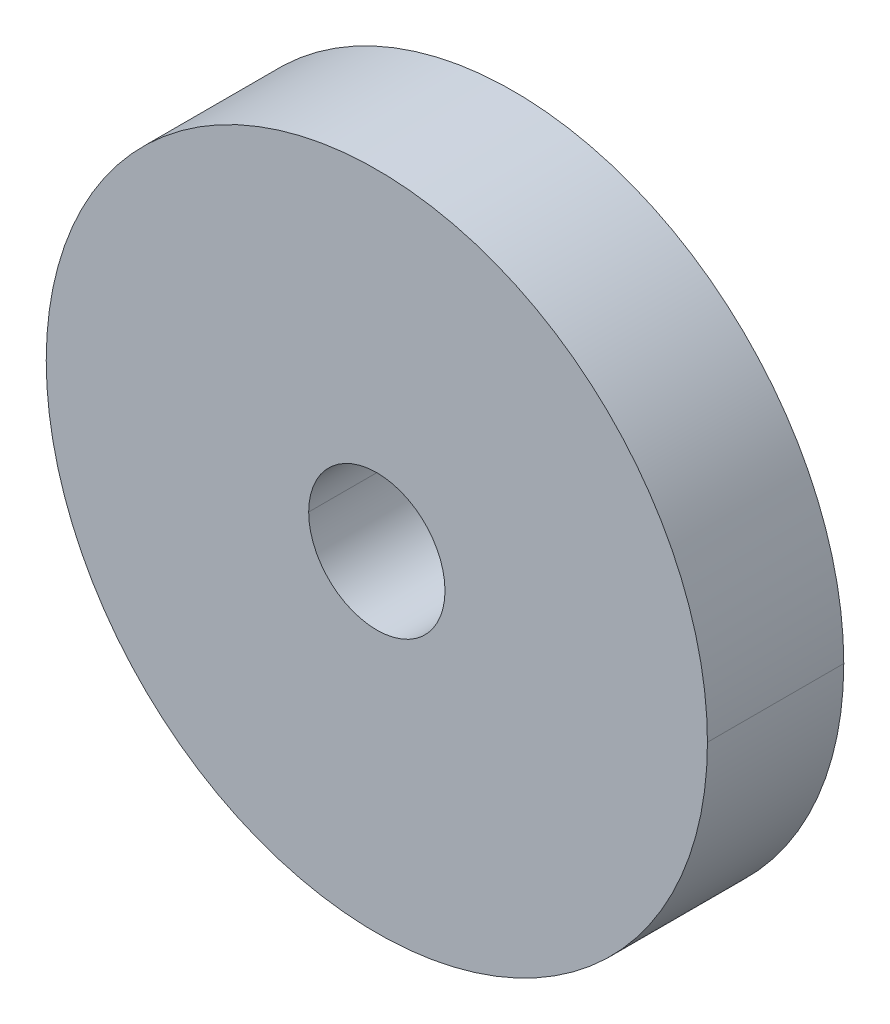
ISO-10303-21;
HEADER;
FILE_DESCRIPTION(('STEP AP214'),'2;1');
FILE_NAME('part.step','',(''),(''),'','','');
FILE_SCHEMA(('AUTOMOTIVE_DESIGN { 1 0 10303 214 1 1 1 1 }'));
ENDSEC;
DATA;
#1=APPLICATION_CONTEXT('core data for automotive mechanical design processes');
#2=APPLICATION_PROTOCOL_DEFINITION('international standard','automotive_design',2000,#1);
#3=PRODUCT_CONTEXT('',#1,'mechanical');
#4=PRODUCT('Part','Part','',(#3));
#5=PRODUCT_RELATED_PRODUCT_CATEGORY('part','',(#4));
#6=PRODUCT_DEFINITION_FORMATION('','',#4);
#7=PRODUCT_DEFINITION_CONTEXT('part definition',#1,'design');
#8=PRODUCT_DEFINITION('design','',#6,#7);
#9=PRODUCT_DEFINITION_SHAPE('','',#8);
#10=(LENGTH_UNIT() NAMED_UNIT(*) SI_UNIT(.MILLI.,.METRE.));
#11=(NAMED_UNIT(*) PLANE_ANGLE_UNIT() SI_UNIT($,.RADIAN.));
#12=(NAMED_UNIT(*) SI_UNIT($,.STERADIAN.) SOLID_ANGLE_UNIT());
#13=UNCERTAINTY_MEASURE_WITH_UNIT(LENGTH_MEASURE(1.E-05),#10,'distance_accuracy_value','');
#14=(GEOMETRIC_REPRESENTATION_CONTEXT(3) GLOBAL_UNCERTAINTY_ASSIGNED_CONTEXT((#13)) GLOBAL_UNIT_ASSIGNED_CONTEXT((#10,
#11,#12)) REPRESENTATION_CONTEXT('',''));
#15=CARTESIAN_POINT('',(0.,0.,0.));
#16=DIRECTION('',(0.,0.,1.));
#17=DIRECTION('',(1.,0.,0.));
#18=AXIS2_PLACEMENT_3D('',#15,#16,#17);
#19=CARTESIAN_POINT('',(0.,0.,2.));
#20=DIRECTION('',(0.,0.,-1.));
#21=DIRECTION('',(-1.,0.,0.));
#22=AXIS2_PLACEMENT_3D('',#19,#20,#21);
#23=CYLINDRICAL_SURFACE('',#22,1.);
#24=DIRECTION('',(0.,0.,-1.));
#25=VECTOR('',#24,1.);
#26=CARTESIAN_POINT('',(1.,0.,2.));
#27=LINE('',#26,#25);
#28=CARTESIAN_POINT('',(1.,0.,2.));
#29=VERTEX_POINT('',#28);
#30=CARTESIAN_POINT('',(1.,0.,0.));
#31=VERTEX_POINT('',#30);
#32=EDGE_CURVE('E87',#29,#31,#27,.T.);
#33=ORIENTED_EDGE('',*,*,#32,.F.);
#34=CARTESIAN_POINT('',(0.,0.,2.));
#35=DIRECTION('',(0.,0.,1.));
#36=DIRECTION('',(1.,0.,0.));
#37=AXIS2_PLACEMENT_3D('',#34,#35,#36);
#38=CIRCLE('',#37,1.);
#39=CARTESIAN_POINT('',(-1.,0.,2.));
#40=VERTEX_POINT('',#39);
#41=EDGE_CURVE('E75',#29,#40,#38,.T.);
#42=ORIENTED_EDGE('',*,*,#41,.T.);
#43=DIRECTION('',(0.,0.,-1.));
#44=VECTOR('',#43,1.);
#45=CARTESIAN_POINT('',(-1.,0.,2.));
#46=LINE('',#45,#44);
#47=CARTESIAN_POINT('',(-1.,0.,0.));
#48=VERTEX_POINT('',#47);
#49=EDGE_CURVE('E84',#40,#48,#46,.T.);
#50=ORIENTED_EDGE('',*,*,#49,.T.);
#51=CARTESIAN_POINT('',(0.,0.,0.));
#52=DIRECTION('',(0.,0.,1.));
#53=DIRECTION('',(1.,0.,0.));
#54=AXIS2_PLACEMENT_3D('',#51,#52,#53);
#55=CIRCLE('',#54,1.);
#56=EDGE_CURVE('E9',#31,#48,#55,.T.);
#57=ORIENTED_EDGE('',*,*,#56,.F.);
#58=EDGE_LOOP('',(#33,#42,#50,#57));
#59=FACE_BOUND('',#58,.T.);
#60=ADVANCED_FACE('F15',(#59),#23,.F.);
#61=CARTESIAN_POINT('',(0.,0.,2.));
#62=DIRECTION('',(0.,0.,-1.));
#63=DIRECTION('',(-1.,0.,0.));
#64=AXIS2_PLACEMENT_3D('',#61,#62,#63);
#65=CYLINDRICAL_SURFACE('',#64,4.85);
#66=DIRECTION('',(0.,0.,-1.));
#67=VECTOR('',#66,1.);
#68=CARTESIAN_POINT('',(4.85,0.,2.));
#69=LINE('',#68,#67);
#70=CARTESIAN_POINT('',(4.85,0.,2.));
#71=VERTEX_POINT('',#70);
#72=CARTESIAN_POINT('',(4.85,0.,0.));
#73=VERTEX_POINT('',#72);
#74=EDGE_CURVE('E109',#71,#73,#69,.T.);
#75=ORIENTED_EDGE('',*,*,#74,.F.);
#76=CARTESIAN_POINT('',(0.,0.,2.));
#77=DIRECTION('',(0.,0.,1.));
#78=DIRECTION('',(1.,0.,0.));
#79=AXIS2_PLACEMENT_3D('',#76,#77,#78);
#80=CIRCLE('',#79,4.85);
#81=CARTESIAN_POINT('',(-4.85,0.,2.));
#82=VERTEX_POINT('',#81);
#83=EDGE_CURVE('E57',#82,#71,#80,.T.);
#84=ORIENTED_EDGE('',*,*,#83,.F.);
#85=DIRECTION('',(0.,0.,-1.));
#86=VECTOR('',#85,1.);
#87=CARTESIAN_POINT('',(-4.85,0.,2.));
#88=LINE('',#87,#86);
#89=CARTESIAN_POINT('',(-4.85,0.,0.));
#90=VERTEX_POINT('',#89);
#91=EDGE_CURVE('E114',#82,#90,#88,.T.);
#92=ORIENTED_EDGE('',*,*,#91,.T.);
#93=CARTESIAN_POINT('',(0.,0.,0.));
#94=DIRECTION('',(0.,0.,1.));
#95=DIRECTION('',(1.,0.,0.));
#96=AXIS2_PLACEMENT_3D('',#93,#94,#95);
#97=CIRCLE('',#96,4.85);
#98=EDGE_CURVE('E26',#90,#73,#97,.T.);
#99=ORIENTED_EDGE('',*,*,#98,.T.);
#100=EDGE_LOOP('',(#75,#84,#92,#99));
#101=FACE_BOUND('',#100,.T.);
#102=ADVANCED_FACE('F131',(#101),#65,.T.);
#103=CARTESIAN_POINT('',(0.,0.,0.));
#104=DIRECTION('',(0.,0.,1.));
#105=DIRECTION('',(1.,0.,0.));
#106=AXIS2_PLACEMENT_3D('',#103,#104,#105);
#107=PLANE('',#106);
#108=CARTESIAN_POINT('',(0.,0.,0.));
#109=DIRECTION('',(0.,0.,1.));
#110=DIRECTION('',(1.,0.,0.));
#111=AXIS2_PLACEMENT_3D('',#108,#109,#110);
#112=CIRCLE('',#111,1.);
#113=EDGE_CURVE('E94',#48,#31,#112,.T.);
#114=ORIENTED_EDGE('',*,*,#113,.T.);
#115=ORIENTED_EDGE('',*,*,#56,.T.);
#116=EDGE_LOOP('',(#114,#115));
#117=FACE_BOUND('',#116,.T.);
#118=ORIENTED_EDGE('',*,*,#98,.F.);
#119=CARTESIAN_POINT('',(0.,0.,0.));
#120=DIRECTION('',(0.,0.,1.));
#121=DIRECTION('',(1.,0.,0.));
#122=AXIS2_PLACEMENT_3D('',#119,#120,#121);
#123=CIRCLE('',#122,4.85);
#124=EDGE_CURVE('E112',#73,#90,#123,.T.);
#125=ORIENTED_EDGE('',*,*,#124,.F.);
#126=EDGE_LOOP('',(#118,#125));
#127=FACE_BOUND('',#126,.T.);
#128=ADVANCED_FACE('F129',(#117,#127),#107,.F.);
#129=CARTESIAN_POINT('',(0.,0.,2.));
#130=DIRECTION('',(0.,0.,1.));
#131=DIRECTION('',(1.,0.,0.));
#132=AXIS2_PLACEMENT_3D('',#129,#130,#131);
#133=PLANE('',#132);
#134=CARTESIAN_POINT('',(0.,0.,2.));
#135=DIRECTION('',(0.,0.,1.));
#136=DIRECTION('',(1.,0.,0.));
#137=AXIS2_PLACEMENT_3D('',#134,#135,#136);
#138=CIRCLE('',#137,1.);
#139=EDGE_CURVE('E19',#40,#29,#138,.T.);
#140=ORIENTED_EDGE('',*,*,#139,.F.);
#141=ORIENTED_EDGE('',*,*,#41,.F.);
#142=EDGE_LOOP('',(#140,#141));
#143=FACE_BOUND('',#142,.T.);
#144=ORIENTED_EDGE('',*,*,#83,.T.);
#145=CARTESIAN_POINT('',(0.,0.,2.));
#146=DIRECTION('',(0.,0.,1.));
#147=DIRECTION('',(1.,0.,0.));
#148=AXIS2_PLACEMENT_3D('',#145,#146,#147);
#149=CIRCLE('',#148,4.85);
#150=EDGE_CURVE('E96',#71,#82,#149,.T.);
#151=ORIENTED_EDGE('',*,*,#150,.T.);
#152=EDGE_LOOP('',(#144,#151));
#153=FACE_BOUND('',#152,.T.);
#154=ADVANCED_FACE('F98',(#143,#153),#133,.T.);
#155=CARTESIAN_POINT('',(0.,0.,2.));
#156=DIRECTION('',(0.,0.,-1.));
#157=DIRECTION('',(-1.,0.,0.));
#158=AXIS2_PLACEMENT_3D('',#155,#156,#157);
#159=CYLINDRICAL_SURFACE('',#158,4.85);
#160=ORIENTED_EDGE('',*,*,#150,.F.);
#161=ORIENTED_EDGE('',*,*,#74,.T.);
#162=ORIENTED_EDGE('',*,*,#124,.T.);
#163=ORIENTED_EDGE('',*,*,#91,.F.);
#164=EDGE_LOOP('',(#160,#161,#162,#163));
#165=FACE_BOUND('',#164,.T.);
#166=ADVANCED_FACE('F17',(#165),#159,.T.);
#167=CARTESIAN_POINT('',(0.,0.,2.));
#168=DIRECTION('',(0.,0.,-1.));
#169=DIRECTION('',(-1.,0.,0.));
#170=AXIS2_PLACEMENT_3D('',#167,#168,#169);
#171=CYLINDRICAL_SURFACE('',#170,1.);
#172=ORIENTED_EDGE('',*,*,#139,.T.);
#173=ORIENTED_EDGE('',*,*,#32,.T.);
#174=ORIENTED_EDGE('',*,*,#113,.F.);
#175=ORIENTED_EDGE('',*,*,#49,.F.);
#176=EDGE_LOOP('',(#172,#173,#174,#175));
#177=FACE_BOUND('',#176,.T.);
#178=ADVANCED_FACE('F92',(#177),#171,.F.);
#179=CLOSED_SHELL('',(#60,#102,#128,#154,#166,#178));
#180=MANIFOLD_SOLID_BREP('B1',#179);
#181=ADVANCED_BREP_SHAPE_REPRESENTATION('',(#18,#180),#14);
#182=SHAPE_DEFINITION_REPRESENTATION(#9,#181);
ENDSEC;
END-ISO-10303-21;
